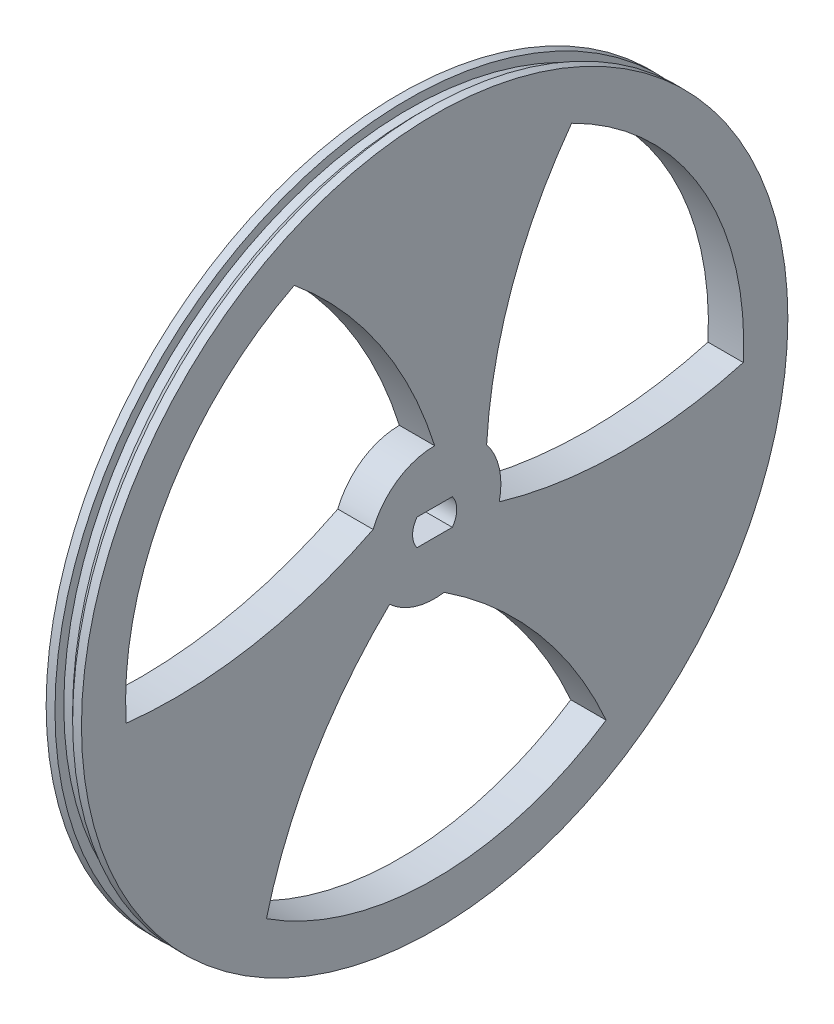
ISO-10303-21;
HEADER;
FILE_DESCRIPTION(('STEP AP214'),'2;1');
FILE_NAME('part.step','',(''),(''),'','','');
FILE_SCHEMA(('AUTOMOTIVE_DESIGN { 1 0 10303 214 1 1 1 1 }'));
ENDSEC;
DATA;
#1=APPLICATION_CONTEXT('core data for automotive mechanical design processes');
#2=APPLICATION_PROTOCOL_DEFINITION('international standard','automotive_design',2000,#1);
#3=PRODUCT_CONTEXT('',#1,'mechanical');
#4=PRODUCT('Part','Part','',(#3));
#5=PRODUCT_RELATED_PRODUCT_CATEGORY('part','',(#4));
#6=PRODUCT_DEFINITION_FORMATION('','',#4);
#7=PRODUCT_DEFINITION_CONTEXT('part definition',#1,'design');
#8=PRODUCT_DEFINITION('design','',#6,#7);
#9=PRODUCT_DEFINITION_SHAPE('','',#8);
#10=(LENGTH_UNIT() NAMED_UNIT(*) SI_UNIT(.MILLI.,.METRE.));
#11=(NAMED_UNIT(*) PLANE_ANGLE_UNIT() SI_UNIT($,.RADIAN.));
#12=(NAMED_UNIT(*) SI_UNIT($,.STERADIAN.) SOLID_ANGLE_UNIT());
#13=UNCERTAINTY_MEASURE_WITH_UNIT(LENGTH_MEASURE(1.E-05),#10,'distance_accuracy_value','');
#14=(GEOMETRIC_REPRESENTATION_CONTEXT(3) GLOBAL_UNCERTAINTY_ASSIGNED_CONTEXT((#13)) GLOBAL_UNIT_ASSIGNED_CONTEXT((#10,
#11,#12)) REPRESENTATION_CONTEXT('',''));
#15=CARTESIAN_POINT('',(0.,0.,0.));
#16=DIRECTION('',(0.,0.,1.));
#17=DIRECTION('',(1.,0.,0.));
#18=AXIS2_PLACEMENT_3D('',#15,#16,#17);
#19=CARTESIAN_POINT('',(-1.59907301805054,0.,0.));
#20=DIRECTION('',(-1.,0.,0.));
#21=DIRECTION('',(0.,0.,1.));
#22=AXIS2_PLACEMENT_3D('',#19,#20,#21);
#23=CYLINDRICAL_SURFACE('',#22,39.);
#24=CARTESIAN_POINT('',(1.,0.,0.));
#25=DIRECTION('',(-1.,0.,0.));
#26=DIRECTION('',(0.,0.,1.));
#27=AXIS2_PLACEMENT_3D('',#24,#25,#26);
#28=CIRCLE('',#27,39.);
#29=CARTESIAN_POINT('',(1.,0.,39.));
#30=VERTEX_POINT('',#29);
#31=EDGE_CURVE('E188',#30,#30,#28,.T.);
#32=ORIENTED_EDGE('',*,*,#31,.F.);
#33=EDGE_LOOP('',(#32));
#34=FACE_BOUND('',#33,.T.);
#35=CARTESIAN_POINT('',(2.,0.,0.));
#36=DIRECTION('',(-1.,0.,0.));
#37=DIRECTION('',(0.,0.,1.));
#38=AXIS2_PLACEMENT_3D('',#35,#36,#37);
#39=CIRCLE('',#38,39.);
#40=CARTESIAN_POINT('',(2.,0.,39.));
#41=VERTEX_POINT('',#40);
#42=EDGE_CURVE('E377',#41,#41,#39,.T.);
#43=ORIENTED_EDGE('',*,*,#42,.T.);
#44=EDGE_LOOP('',(#43));
#45=FACE_BOUND('',#44,.T.);
#46=ADVANCED_FACE('F39',(#34,#45),#23,.T.);
#47=CARTESIAN_POINT('',(4.,0.,0.));
#48=DIRECTION('',(-1.,0.,0.));
#49=DIRECTION('',(0.,0.,1.));
#50=AXIS2_PLACEMENT_3D('',#47,#48,#49);
#51=CYLINDRICAL_SURFACE('',#50,40.);
#52=CARTESIAN_POINT('',(0.,0.,0.));
#53=DIRECTION('',(1.,0.,0.));
#54=DIRECTION('',(0.,0.,-1.));
#55=AXIS2_PLACEMENT_3D('',#52,#53,#54);
#56=CIRCLE('',#55,40.);
#57=CARTESIAN_POINT('',(0.,0.,-40.));
#58=VERTEX_POINT('',#57);
#59=EDGE_CURVE('E43',#58,#58,#56,.T.);
#60=ORIENTED_EDGE('',*,*,#59,.T.);
#61=EDGE_LOOP('',(#60));
#62=FACE_BOUND('',#61,.T.);
#63=CARTESIAN_POINT('',(1.,0.,0.));
#64=DIRECTION('',(-1.,0.,0.));
#65=DIRECTION('',(0.,0.,1.));
#66=AXIS2_PLACEMENT_3D('',#63,#64,#65);
#67=CIRCLE('',#66,40.);
#68=CARTESIAN_POINT('',(1.,0.,40.));
#69=VERTEX_POINT('',#68);
#70=EDGE_CURVE('E383',#69,#69,#67,.T.);
#71=ORIENTED_EDGE('',*,*,#70,.T.);
#72=EDGE_LOOP('',(#71));
#73=FACE_BOUND('',#72,.T.);
#74=ADVANCED_FACE('F41',(#62,#73),#51,.T.);
#75=CARTESIAN_POINT('',(4.,0.,0.));
#76=DIRECTION('',(1.,0.,0.));
#77=DIRECTION('',(0.,0.,-1.));
#78=AXIS2_PLACEMENT_3D('',#75,#76,#77);
#79=CIRCLE('',#78,40.);
#80=CARTESIAN_POINT('',(4.,0.,-40.));
#81=VERTEX_POINT('',#80);
#82=EDGE_CURVE('E11',#81,#81,#79,.T.);
#83=ORIENTED_EDGE('',*,*,#82,.F.);
#84=EDGE_LOOP('',(#83));
#85=FACE_BOUND('',#84,.T.);
#86=CARTESIAN_POINT('',(3.,0.,0.));
#87=DIRECTION('',(-1.,0.,0.));
#88=DIRECTION('',(0.,0.,1.));
#89=AXIS2_PLACEMENT_3D('',#86,#87,#88);
#90=CIRCLE('',#89,40.);
#91=CARTESIAN_POINT('',(3.,0.,40.));
#92=VERTEX_POINT('',#91);
#93=EDGE_CURVE('E380',#92,#92,#90,.T.);
#94=ORIENTED_EDGE('',*,*,#93,.F.);
#95=EDGE_LOOP('',(#94));
#96=FACE_BOUND('',#95,.T.);
#97=ADVANCED_FACE('F366',(#85,#96),#51,.T.);
#98=CARTESIAN_POINT('',(4.,0.,0.));
#99=DIRECTION('',(1.,0.,0.));
#100=DIRECTION('',(0.,0.,-1.));
#101=AXIS2_PLACEMENT_3D('',#98,#99,#100);
#102=PLANE('',#101);
#103=ORIENTED_EDGE('',*,*,#82,.T.);
#104=EDGE_LOOP('',(#103));
#105=FACE_BOUND('',#104,.T.);
#106=DIRECTION('',(0.,0.,1.));
#107=VECTOR('',#106,1.);
#108=CARTESIAN_POINT('',(4.,1.5,2.));
#109=LINE('',#108,#107);
#110=CARTESIAN_POINT('',(4.,1.5,-2.));
#111=VERTEX_POINT('',#110);
#112=CARTESIAN_POINT('',(4.,1.5,2.));
#113=VERTEX_POINT('',#112);
#114=EDGE_CURVE('E293',#111,#113,#109,.T.);
#115=ORIENTED_EDGE('',*,*,#114,.F.);
#116=CARTESIAN_POINT('',(4.,0.,0.));
#117=DIRECTION('',(1.,0.,0.));
#118=DIRECTION('',(0.,0.,-1.));
#119=AXIS2_PLACEMENT_3D('',#116,#117,#118);
#120=CIRCLE('',#119,2.5);
#121=CARTESIAN_POINT('',(4.,-1.5,-2.));
#122=VERTEX_POINT('',#121);
#123=EDGE_CURVE('E290',#122,#111,#120,.T.);
#124=ORIENTED_EDGE('',*,*,#123,.F.);
#125=DIRECTION('',(0.,0.,-1.));
#126=VECTOR('',#125,1.);
#127=CARTESIAN_POINT('',(4.,-1.5,-2.));
#128=LINE('',#127,#126);
#129=CARTESIAN_POINT('',(4.,-1.5,2.));
#130=VERTEX_POINT('',#129);
#131=EDGE_CURVE('E301',#130,#122,#128,.T.);
#132=ORIENTED_EDGE('',*,*,#131,.F.);
#133=CARTESIAN_POINT('',(4.,0.,0.));
#134=DIRECTION('',(1.,0.,0.));
#135=DIRECTION('',(0.,0.,-1.));
#136=AXIS2_PLACEMENT_3D('',#133,#134,#135);
#137=CIRCLE('',#136,2.5);
#138=EDGE_CURVE('E297',#113,#130,#137,.T.);
#139=ORIENTED_EDGE('',*,*,#138,.F.);
#140=EDGE_LOOP('',(#115,#124,#132,#139));
#141=FACE_BOUND('',#140,.T.);
#142=CARTESIAN_POINT('',(4.,1.76584881371052,-55.8030158301804));
#143=DIRECTION('',(1.,0.,0.));
#144=DIRECTION('',(0.,0.,1.));
#145=AXIS2_PLACEMENT_3D('',#142,#143,#144);
#146=CIRCLE('',#145,50.);
#147=CARTESIAN_POINT('',(4.,31.3745456526574,-15.5125073759634));
#148=VERTEX_POINT('',#147);
#149=CARTESIAN_POINT('',(4.,4.64792982990707,-5.88614885101115));
#150=VERTEX_POINT('',#149);
#151=EDGE_CURVE('E250',#148,#150,#146,.T.);
#152=ORIENTED_EDGE('',*,*,#151,.F.);
#153=CARTESIAN_POINT('',(4.,0.,0.));
#154=DIRECTION('',(1.,0.,0.));
#155=DIRECTION('',(0.,0.,-1.));
#156=AXIS2_PLACEMENT_3D('',#153,#154,#155);
#157=CIRCLE('',#156,35.);
#158=CARTESIAN_POINT('',(4.,-1.81692167953096,-34.9528081219585));
#159=VERTEX_POINT('',#158);
#160=EDGE_CURVE('E247',#159,#148,#157,.T.);
#161=ORIENTED_EDGE('',*,*,#160,.F.);
#162=CARTESIAN_POINT('',(4.,46.3109136480361,-21.3987878075799));
#163=DIRECTION('',(1.,0.,0.));
#164=DIRECTION('',(0.,0.,-1.));
#165=AXIS2_PLACEMENT_3D('',#162,#163,#164);
#166=CIRCLE('',#165,50.);
#167=CARTESIAN_POINT('',(4.,-1.66400418565392,-7.31307664872495));
#168=VERTEX_POINT('',#167);
#169=EDGE_CURVE('E258',#168,#159,#166,.T.);
#170=ORIENTED_EDGE('',*,*,#169,.F.);
#171=CARTESIAN_POINT('',(4.,0.,0.));
#172=DIRECTION('',(-1.,0.,0.));
#173=DIRECTION('',(0.,0.,-1.));
#174=AXIS2_PLACEMENT_3D('',#171,#172,#173);
#175=CIRCLE('',#174,7.5);
#176=EDGE_CURVE('E254',#150,#168,#175,.T.);
#177=ORIENTED_EDGE('',*,*,#176,.F.);
#178=EDGE_LOOP('',(#152,#161,#170,#177));
#179=FACE_BOUND('',#178,.T.);
#180=CARTESIAN_POINT('',(4.,0.,0.));
#181=DIRECTION('',(1.,0.,0.));
#182=DIRECTION('',(0.,0.,-1.));
#183=AXIS2_PLACEMENT_3D('',#180,#181,#182);
#184=CIRCLE('',#183,35.);
#185=CARTESIAN_POINT('',(4.,31.1784806069845,15.9029037298189));
#186=VERTEX_POINT('',#185);
#187=CARTESIAN_POINT('',(4.,-2.25304736235283,34.9274072553775));
#188=VERTEX_POINT('',#187);
#189=EDGE_CURVE('E207',#186,#188,#184,.T.);
#190=ORIENTED_EDGE('',*,*,#189,.F.);
#191=CARTESIAN_POINT('',(4.,-7.37984247753008,47.7345816766408));
#192=DIRECTION('',(1.,0.,0.));
#193=DIRECTION('',(0.,0.,-1.));
#194=AXIS2_PLACEMENT_3D('',#191,#192,#193);
#195=CIRCLE('',#194,50.);
#196=CARTESIAN_POINT('',(4.,7.5,0.));
#197=VERTEX_POINT('',#196);
#198=EDGE_CURVE('E204',#197,#186,#195,.T.);
#199=ORIENTED_EDGE('',*,*,#198,.F.);
#200=CARTESIAN_POINT('',(4.,0.,0.));
#201=DIRECTION('',(-1.,0.,0.));
#202=DIRECTION('',(0.,0.,-1.));
#203=AXIS2_PLACEMENT_3D('',#200,#201,#202);
#204=CIRCLE('',#203,7.5);
#205=CARTESIAN_POINT('',(4.,2.77358952047597,6.96829973321368));
#206=VERTEX_POINT('',#205);
#207=EDGE_CURVE('E215',#206,#197,#204,.T.);
#208=ORIENTED_EDGE('',*,*,#207,.F.);
#209=CARTESIAN_POINT('',(4.,47.4439049098642,29.4307778470056));
#210=DIRECTION('',(1.,0.,0.));
#211=DIRECTION('',(0.,0.,1.));
#212=AXIS2_PLACEMENT_3D('',#209,#210,#211);
#213=CIRCLE('',#212,50.);
#214=EDGE_CURVE('E211',#188,#206,#213,.T.);
#215=ORIENTED_EDGE('',*,*,#214,.F.);
#216=EDGE_LOOP('',(#190,#199,#208,#215));
#217=FACE_BOUND('',#216,.T.);
#218=CARTESIAN_POINT('',(4.,-49.2097537235772,26.3722379831724));
#219=DIRECTION('',(1.,0.,0.));
#220=DIRECTION('',(0.,0.,1.));
#221=AXIS2_PLACEMENT_3D('',#218,#219,#220);
#222=CIRCLE('',#221,50.);
#223=CARTESIAN_POINT('',(4.,-29.1214982903056,-19.4148998794156));
#224=VERTEX_POINT('',#223);
#225=CARTESIAN_POINT('',(4.,-7.42151935038565,-1.08215088220237));
#226=VERTEX_POINT('',#225);
#227=EDGE_CURVE('E162',#224,#226,#222,.T.);
#228=ORIENTED_EDGE('',*,*,#227,.F.);
#229=CARTESIAN_POINT('',(4.,0.,0.));
#230=DIRECTION('',(1.,0.,0.));
#231=DIRECTION('',(0.,0.,-1.));
#232=AXIS2_PLACEMENT_3D('',#229,#230,#231);
#233=CIRCLE('',#232,35.);
#234=CARTESIAN_POINT('',(4.,-29.3615589274536,19.0499043921399));
#235=VERTEX_POINT('',#234);
#236=EDGE_CURVE('E153',#235,#224,#233,.T.);
#237=ORIENTED_EDGE('',*,*,#236,.F.);
#238=CARTESIAN_POINT('',(4.,-41.6873506755751,-29.4070337878766));
#239=DIRECTION('',(1.,0.,0.));
#240=DIRECTION('',(0.,0.,-1.));
#241=AXIS2_PLACEMENT_3D('',#238,#239,#240);
#242=CIRCLE('',#241,50.);
#243=CARTESIAN_POINT('',(4.,-5.50130806479159,5.09760822114245));
#244=VERTEX_POINT('',#243);
#245=EDGE_CURVE('E180',#244,#235,#242,.T.);
#246=ORIENTED_EDGE('',*,*,#245,.F.);
#247=CARTESIAN_POINT('',(4.,0.,0.));
#248=DIRECTION('',(-1.,0.,0.));
#249=DIRECTION('',(0.,0.,-1.));
#250=AXIS2_PLACEMENT_3D('',#247,#248,#249);
#251=CIRCLE('',#250,7.5);
#252=EDGE_CURVE('E176',#226,#244,#251,.T.);
#253=ORIENTED_EDGE('',*,*,#252,.F.);
#254=EDGE_LOOP('',(#228,#237,#246,#253));
#255=FACE_BOUND('',#254,.T.);
#256=ADVANCED_FACE('F175',(#105,#141,#179,#217,#255),#102,.T.);
#257=CARTESIAN_POINT('',(0.,0.,0.));
#258=DIRECTION('',(1.,0.,0.));
#259=DIRECTION('',(0.,0.,-1.));
#260=AXIS2_PLACEMENT_3D('',#257,#258,#259);
#261=PLANE('',#260);
#262=CARTESIAN_POINT('',(0.,-7.37984247753008,47.7345816766408));
#263=DIRECTION('',(1.,0.,0.));
#264=DIRECTION('',(0.,0.,-1.));
#265=AXIS2_PLACEMENT_3D('',#262,#263,#264);
#266=CIRCLE('',#265,50.);
#267=CARTESIAN_POINT('',(0.,7.5,0.));
#268=VERTEX_POINT('',#267);
#269=CARTESIAN_POINT('',(0.,31.1784806069845,15.9029037298189));
#270=VERTEX_POINT('',#269);
#271=EDGE_CURVE('E171',#268,#270,#266,.T.);
#272=ORIENTED_EDGE('',*,*,#271,.T.);
#273=CARTESIAN_POINT('',(0.,0.,0.));
#274=DIRECTION('',(1.,0.,0.));
#275=DIRECTION('',(0.,0.,-1.));
#276=AXIS2_PLACEMENT_3D('',#273,#274,#275);
#277=CIRCLE('',#276,35.);
#278=CARTESIAN_POINT('',(0.,-2.25304736235283,34.9274072553775));
#279=VERTEX_POINT('',#278);
#280=EDGE_CURVE('E222',#270,#279,#277,.T.);
#281=ORIENTED_EDGE('',*,*,#280,.T.);
#282=CARTESIAN_POINT('',(0.,47.4439049098642,29.4307778470056));
#283=DIRECTION('',(1.,0.,0.));
#284=DIRECTION('',(0.,0.,1.));
#285=AXIS2_PLACEMENT_3D('',#282,#283,#284);
#286=CIRCLE('',#285,50.);
#287=CARTESIAN_POINT('',(0.,2.77358952047597,6.96829973321369));
#288=VERTEX_POINT('',#287);
#289=EDGE_CURVE('E226',#279,#288,#286,.T.);
#290=ORIENTED_EDGE('',*,*,#289,.T.);
#291=CARTESIAN_POINT('',(0.,0.,0.));
#292=DIRECTION('',(-1.,0.,0.));
#293=DIRECTION('',(0.,0.,-1.));
#294=AXIS2_PLACEMENT_3D('',#291,#292,#293);
#295=CIRCLE('',#294,7.5);
#296=EDGE_CURVE('E208',#288,#268,#295,.T.);
#297=ORIENTED_EDGE('',*,*,#296,.T.);
#298=EDGE_LOOP('',(#272,#281,#290,#297));
#299=FACE_BOUND('',#298,.T.);
#300=CARTESIAN_POINT('',(0.,0.,0.));
#301=DIRECTION('',(1.,0.,0.));
#302=DIRECTION('',(0.,0.,-1.));
#303=AXIS2_PLACEMENT_3D('',#300,#301,#302);
#304=CIRCLE('',#303,2.5);
#305=CARTESIAN_POINT('',(0.,-1.5,-2.));
#306=VERTEX_POINT('',#305);
#307=CARTESIAN_POINT('',(0.,1.5,-2.));
#308=VERTEX_POINT('',#307);
#309=EDGE_CURVE('E289',#306,#308,#304,.T.);
#310=ORIENTED_EDGE('',*,*,#309,.T.);
#311=DIRECTION('',(0.,0.,1.));
#312=VECTOR('',#311,1.);
#313=CARTESIAN_POINT('',(0.,1.5,2.));
#314=LINE('',#313,#312);
#315=CARTESIAN_POINT('',(0.,1.5,2.));
#316=VERTEX_POINT('',#315);
#317=EDGE_CURVE('E308',#308,#316,#314,.T.);
#318=ORIENTED_EDGE('',*,*,#317,.T.);
#319=CARTESIAN_POINT('',(0.,0.,0.));
#320=DIRECTION('',(1.,0.,0.));
#321=DIRECTION('',(0.,0.,-1.));
#322=AXIS2_PLACEMENT_3D('',#319,#320,#321);
#323=CIRCLE('',#322,2.5);
#324=CARTESIAN_POINT('',(0.,-1.5,2.));
#325=VERTEX_POINT('',#324);
#326=EDGE_CURVE('E312',#316,#325,#323,.T.);
#327=ORIENTED_EDGE('',*,*,#326,.T.);
#328=DIRECTION('',(0.,0.,-1.));
#329=VECTOR('',#328,1.);
#330=CARTESIAN_POINT('',(0.,-1.5,-2.));
#331=LINE('',#330,#329);
#332=EDGE_CURVE('E294',#325,#306,#331,.T.);
#333=ORIENTED_EDGE('',*,*,#332,.T.);
#334=EDGE_LOOP('',(#310,#318,#327,#333));
#335=FACE_BOUND('',#334,.T.);
#336=ORIENTED_EDGE('',*,*,#59,.F.);
#337=EDGE_LOOP('',(#336));
#338=FACE_BOUND('',#337,.T.);
#339=CARTESIAN_POINT('',(0.,0.,0.));
#340=DIRECTION('',(1.,0.,0.));
#341=DIRECTION('',(0.,0.,-1.));
#342=AXIS2_PLACEMENT_3D('',#339,#340,#341);
#343=CIRCLE('',#342,35.);
#344=CARTESIAN_POINT('',(0.,-1.81692167953095,-34.9528081219585));
#345=VERTEX_POINT('',#344);
#346=CARTESIAN_POINT('',(0.,31.3745456526574,-15.5125073759634));
#347=VERTEX_POINT('',#346);
#348=EDGE_CURVE('E246',#345,#347,#343,.T.);
#349=ORIENTED_EDGE('',*,*,#348,.T.);
#350=CARTESIAN_POINT('',(0.,1.76584881371052,-55.8030158301804));
#351=DIRECTION('',(1.,0.,0.));
#352=DIRECTION('',(0.,0.,1.));
#353=AXIS2_PLACEMENT_3D('',#350,#351,#352);
#354=CIRCLE('',#353,50.);
#355=CARTESIAN_POINT('',(0.,4.64792982990707,-5.88614885101115));
#356=VERTEX_POINT('',#355);
#357=EDGE_CURVE('E265',#347,#356,#354,.T.);
#358=ORIENTED_EDGE('',*,*,#357,.T.);
#359=CARTESIAN_POINT('',(0.,0.,0.));
#360=DIRECTION('',(-1.,0.,0.));
#361=DIRECTION('',(0.,0.,-1.));
#362=AXIS2_PLACEMENT_3D('',#359,#360,#361);
#363=CIRCLE('',#362,7.5);
#364=CARTESIAN_POINT('',(0.,-1.66400418565392,-7.31307664872495));
#365=VERTEX_POINT('',#364);
#366=EDGE_CURVE('E269',#356,#365,#363,.T.);
#367=ORIENTED_EDGE('',*,*,#366,.T.);
#368=CARTESIAN_POINT('',(0.,46.3109136480361,-21.3987878075799));
#369=DIRECTION('',(1.,0.,0.));
#370=DIRECTION('',(0.,0.,-1.));
#371=AXIS2_PLACEMENT_3D('',#368,#369,#370);
#372=CIRCLE('',#371,50.);
#373=EDGE_CURVE('E251',#365,#345,#372,.T.);
#374=ORIENTED_EDGE('',*,*,#373,.T.);
#375=EDGE_LOOP('',(#349,#358,#367,#374));
#376=FACE_BOUND('',#375,.T.);
#377=CARTESIAN_POINT('',(0.,0.,0.));
#378=DIRECTION('',(1.,0.,0.));
#379=DIRECTION('',(0.,0.,-1.));
#380=AXIS2_PLACEMENT_3D('',#377,#378,#379);
#381=CIRCLE('',#380,35.);
#382=CARTESIAN_POINT('',(0.,-29.3615589274536,19.0499043921399));
#383=VERTEX_POINT('',#382);
#384=CARTESIAN_POINT('',(0.,-29.1214982903056,-19.4148998794156));
#385=VERTEX_POINT('',#384);
#386=EDGE_CURVE('E63',#383,#385,#381,.T.);
#387=ORIENTED_EDGE('',*,*,#386,.T.);
#388=CARTESIAN_POINT('',(0.,-49.2097537235772,26.3722379831724));
#389=DIRECTION('',(1.,0.,0.));
#390=DIRECTION('',(0.,0.,1.));
#391=AXIS2_PLACEMENT_3D('',#388,#389,#390);
#392=CIRCLE('',#391,50.);
#393=CARTESIAN_POINT('',(0.,-7.42151935038565,-1.08215088220237));
#394=VERTEX_POINT('',#393);
#395=EDGE_CURVE('E169',#385,#394,#392,.T.);
#396=ORIENTED_EDGE('',*,*,#395,.T.);
#397=CARTESIAN_POINT('',(0.,0.,0.));
#398=DIRECTION('',(-1.,0.,0.));
#399=DIRECTION('',(0.,0.,-1.));
#400=AXIS2_PLACEMENT_3D('',#397,#398,#399);
#401=CIRCLE('',#400,7.5);
#402=CARTESIAN_POINT('',(0.,-5.50130806479159,5.09760822114244));
#403=VERTEX_POINT('',#402);
#404=EDGE_CURVE('E191',#394,#403,#401,.T.);
#405=ORIENTED_EDGE('',*,*,#404,.T.);
#406=CARTESIAN_POINT('',(0.,-41.6873506755751,-29.4070337878766));
#407=DIRECTION('',(1.,0.,0.));
#408=DIRECTION('',(0.,0.,-1.));
#409=AXIS2_PLACEMENT_3D('',#406,#407,#408);
#410=CIRCLE('',#409,50.);
#411=EDGE_CURVE('E163',#403,#383,#410,.T.);
#412=ORIENTED_EDGE('',*,*,#411,.T.);
#413=EDGE_LOOP('',(#387,#396,#405,#412));
#414=FACE_BOUND('',#413,.T.);
#415=ADVANCED_FACE('F339',(#299,#335,#338,#376,#414),#261,.F.);
#416=CARTESIAN_POINT('',(4.,0.,0.));
#417=DIRECTION('',(-1.,0.,0.));
#418=DIRECTION('',(0.,0.,1.));
#419=AXIS2_PLACEMENT_3D('',#416,#417,#418);
#420=CYLINDRICAL_SURFACE('',#419,2.5);
#421=ORIENTED_EDGE('',*,*,#309,.F.);
#422=DIRECTION('',(-1.,0.,0.));
#423=VECTOR('',#422,1.);
#424=CARTESIAN_POINT('',(4.,-1.5,-2.));
#425=LINE('',#424,#423);
#426=EDGE_CURVE('E304',#122,#306,#425,.T.);
#427=ORIENTED_EDGE('',*,*,#426,.F.);
#428=ORIENTED_EDGE('',*,*,#123,.T.);
#429=DIRECTION('',(-1.,0.,0.));
#430=VECTOR('',#429,1.);
#431=CARTESIAN_POINT('',(4.,1.5,-2.));
#432=LINE('',#431,#430);
#433=EDGE_CURVE('E328',#111,#308,#432,.T.);
#434=ORIENTED_EDGE('',*,*,#433,.T.);
#435=EDGE_LOOP('',(#421,#427,#428,#434));
#436=FACE_BOUND('',#435,.T.);
#437=ADVANCED_FACE('F342',(#436),#420,.F.);
#438=CARTESIAN_POINT('',(4.,1.5,2.));
#439=DIRECTION('',(0.,-1.,0.));
#440=DIRECTION('',(0.,0.,-1.));
#441=AXIS2_PLACEMENT_3D('',#438,#439,#440);
#442=PLANE('',#441);
#443=ORIENTED_EDGE('',*,*,#317,.F.);
#444=ORIENTED_EDGE('',*,*,#433,.F.);
#445=ORIENTED_EDGE('',*,*,#114,.T.);
#446=DIRECTION('',(-1.,0.,0.));
#447=VECTOR('',#446,1.);
#448=CARTESIAN_POINT('',(4.,1.5,2.));
#449=LINE('',#448,#447);
#450=EDGE_CURVE('E325',#113,#316,#449,.T.);
#451=ORIENTED_EDGE('',*,*,#450,.T.);
#452=EDGE_LOOP('',(#443,#444,#445,#451));
#453=FACE_BOUND('',#452,.T.);
#454=ADVANCED_FACE('F466',(#453),#442,.T.);
#455=CARTESIAN_POINT('',(4.,0.,0.));
#456=DIRECTION('',(-1.,0.,0.));
#457=DIRECTION('',(0.,0.,1.));
#458=AXIS2_PLACEMENT_3D('',#455,#456,#457);
#459=CYLINDRICAL_SURFACE('',#458,2.5);
#460=ORIENTED_EDGE('',*,*,#326,.F.);
#461=ORIENTED_EDGE('',*,*,#450,.F.);
#462=ORIENTED_EDGE('',*,*,#138,.T.);
#463=DIRECTION('',(-1.,0.,0.));
#464=VECTOR('',#463,1.);
#465=CARTESIAN_POINT('',(4.,-1.5,2.));
#466=LINE('',#465,#464);
#467=EDGE_CURVE('E322',#130,#325,#466,.T.);
#468=ORIENTED_EDGE('',*,*,#467,.T.);
#469=EDGE_LOOP('',(#460,#461,#462,#468));
#470=FACE_BOUND('',#469,.T.);
#471=ADVANCED_FACE('F462',(#470),#459,.F.);
#472=CARTESIAN_POINT('',(4.,-1.5,-2.));
#473=DIRECTION('',(0.,1.,0.));
#474=DIRECTION('',(0.,0.,1.));
#475=AXIS2_PLACEMENT_3D('',#472,#473,#474);
#476=PLANE('',#475);
#477=ORIENTED_EDGE('',*,*,#332,.F.);
#478=ORIENTED_EDGE('',*,*,#467,.F.);
#479=ORIENTED_EDGE('',*,*,#131,.T.);
#480=ORIENTED_EDGE('',*,*,#426,.T.);
#481=EDGE_LOOP('',(#477,#478,#479,#480));
#482=FACE_BOUND('',#481,.T.);
#483=ADVANCED_FACE('F458',(#482),#476,.T.);
#484=CARTESIAN_POINT('',(4.,0.,0.));
#485=DIRECTION('',(-1.,0.,0.));
#486=DIRECTION('',(0.,0.,1.));
#487=AXIS2_PLACEMENT_3D('',#484,#485,#486);
#488=CYLINDRICAL_SURFACE('',#487,35.);
#489=ORIENTED_EDGE('',*,*,#348,.F.);
#490=DIRECTION('',(-1.,0.,0.));
#491=VECTOR('',#490,1.);
#492=CARTESIAN_POINT('',(4.,-1.81692167953096,-34.9528081219585));
#493=LINE('',#492,#491);
#494=EDGE_CURVE('E261',#159,#345,#493,.T.);
#495=ORIENTED_EDGE('',*,*,#494,.F.);
#496=ORIENTED_EDGE('',*,*,#160,.T.);
#497=DIRECTION('',(-1.,0.,0.));
#498=VECTOR('',#497,1.);
#499=CARTESIAN_POINT('',(4.,31.3745456526574,-15.5125073759634));
#500=LINE('',#499,#498);
#501=EDGE_CURVE('E285',#148,#347,#500,.T.);
#502=ORIENTED_EDGE('',*,*,#501,.T.);
#503=EDGE_LOOP('',(#489,#495,#496,#502));
#504=FACE_BOUND('',#503,.T.);
#505=ADVANCED_FACE('F454',(#504),#488,.F.);
#506=CARTESIAN_POINT('',(4.,1.76584881371052,-55.8030158301804));
#507=DIRECTION('',(-1.,0.,0.));
#508=DIRECTION('',(0.,0.,1.));
#509=AXIS2_PLACEMENT_3D('',#506,#507,#508);
#510=CYLINDRICAL_SURFACE('',#509,50.);
#511=ORIENTED_EDGE('',*,*,#357,.F.);
#512=ORIENTED_EDGE('',*,*,#501,.F.);
#513=ORIENTED_EDGE('',*,*,#151,.T.);
#514=DIRECTION('',(-1.,0.,0.));
#515=VECTOR('',#514,1.);
#516=CARTESIAN_POINT('',(4.,4.64792982990707,-5.88614885101115));
#517=LINE('',#516,#515);
#518=EDGE_CURVE('E282',#150,#356,#517,.T.);
#519=ORIENTED_EDGE('',*,*,#518,.T.);
#520=EDGE_LOOP('',(#511,#512,#513,#519));
#521=FACE_BOUND('',#520,.T.);
#522=ADVANCED_FACE('F450',(#521),#510,.F.);
#523=CARTESIAN_POINT('',(4.,0.,0.));
#524=DIRECTION('',(-1.,0.,0.));
#525=DIRECTION('',(0.,0.,1.));
#526=AXIS2_PLACEMENT_3D('',#523,#524,#525);
#527=CYLINDRICAL_SURFACE('',#526,7.5);
#528=ORIENTED_EDGE('',*,*,#366,.F.);
#529=ORIENTED_EDGE('',*,*,#518,.F.);
#530=ORIENTED_EDGE('',*,*,#176,.T.);
#531=DIRECTION('',(-1.,0.,0.));
#532=VECTOR('',#531,1.);
#533=CARTESIAN_POINT('',(4.,-1.66400418565392,-7.31307664872495));
#534=LINE('',#533,#532);
#535=EDGE_CURVE('E279',#168,#365,#534,.T.);
#536=ORIENTED_EDGE('',*,*,#535,.T.);
#537=EDGE_LOOP('',(#528,#529,#530,#536));
#538=FACE_BOUND('',#537,.T.);
#539=ADVANCED_FACE('F446',(#538),#527,.T.);
#540=CARTESIAN_POINT('',(4.,46.3109136480361,-21.3987878075799));
#541=DIRECTION('',(-1.,0.,0.));
#542=DIRECTION('',(0.,0.,1.));
#543=AXIS2_PLACEMENT_3D('',#540,#541,#542);
#544=CYLINDRICAL_SURFACE('',#543,50.);
#545=ORIENTED_EDGE('',*,*,#373,.F.);
#546=ORIENTED_EDGE('',*,*,#535,.F.);
#547=ORIENTED_EDGE('',*,*,#169,.T.);
#548=ORIENTED_EDGE('',*,*,#494,.T.);
#549=EDGE_LOOP('',(#545,#546,#547,#548));
#550=FACE_BOUND('',#549,.T.);
#551=ADVANCED_FACE('F443',(#550),#544,.F.);
#552=CARTESIAN_POINT('',(4.,-7.37984247753008,47.7345816766408));
#553=DIRECTION('',(-1.,0.,0.));
#554=DIRECTION('',(0.,0.,1.));
#555=AXIS2_PLACEMENT_3D('',#552,#553,#554);
#556=CYLINDRICAL_SURFACE('',#555,50.);
#557=ORIENTED_EDGE('',*,*,#271,.F.);
#558=DIRECTION('',(-1.,0.,0.));
#559=VECTOR('',#558,1.);
#560=CARTESIAN_POINT('',(4.,7.5,0.));
#561=LINE('',#560,#559);
#562=EDGE_CURVE('E218',#197,#268,#561,.T.);
#563=ORIENTED_EDGE('',*,*,#562,.F.);
#564=ORIENTED_EDGE('',*,*,#198,.T.);
#565=DIRECTION('',(-1.,0.,0.));
#566=VECTOR('',#565,1.);
#567=CARTESIAN_POINT('',(4.,31.1784806069845,15.9029037298189));
#568=LINE('',#567,#566);
#569=EDGE_CURVE('E242',#186,#270,#568,.T.);
#570=ORIENTED_EDGE('',*,*,#569,.T.);
#571=EDGE_LOOP('',(#557,#563,#564,#570));
#572=FACE_BOUND('',#571,.T.);
#573=ADVANCED_FACE('F425',(#572),#556,.F.);
#574=CARTESIAN_POINT('',(4.,0.,0.));
#575=DIRECTION('',(-1.,0.,0.));
#576=DIRECTION('',(0.,0.,1.));
#577=AXIS2_PLACEMENT_3D('',#574,#575,#576);
#578=CYLINDRICAL_SURFACE('',#577,35.);
#579=ORIENTED_EDGE('',*,*,#280,.F.);
#580=ORIENTED_EDGE('',*,*,#569,.F.);
#581=ORIENTED_EDGE('',*,*,#189,.T.);
#582=DIRECTION('',(-1.,0.,0.));
#583=VECTOR('',#582,1.);
#584=CARTESIAN_POINT('',(4.,-2.25304736235283,34.9274072553775));
#585=LINE('',#584,#583);
#586=EDGE_CURVE('E239',#188,#279,#585,.T.);
#587=ORIENTED_EDGE('',*,*,#586,.T.);
#588=EDGE_LOOP('',(#579,#580,#581,#587));
#589=FACE_BOUND('',#588,.T.);
#590=ADVANCED_FACE('F418',(#589),#578,.F.);
#591=CARTESIAN_POINT('',(4.,47.4439049098642,29.4307778470056));
#592=DIRECTION('',(-1.,0.,0.));
#593=DIRECTION('',(0.,0.,1.));
#594=AXIS2_PLACEMENT_3D('',#591,#592,#593);
#595=CYLINDRICAL_SURFACE('',#594,50.);
#596=ORIENTED_EDGE('',*,*,#289,.F.);
#597=ORIENTED_EDGE('',*,*,#586,.F.);
#598=ORIENTED_EDGE('',*,*,#214,.T.);
#599=DIRECTION('',(-1.,0.,0.));
#600=VECTOR('',#599,1.);
#601=CARTESIAN_POINT('',(4.,2.77358952047597,6.96829973321369));
#602=LINE('',#601,#600);
#603=EDGE_CURVE('E236',#206,#288,#602,.T.);
#604=ORIENTED_EDGE('',*,*,#603,.T.);
#605=EDGE_LOOP('',(#596,#597,#598,#604));
#606=FACE_BOUND('',#605,.T.);
#607=ADVANCED_FACE('F421',(#606),#595,.F.);
#608=CARTESIAN_POINT('',(4.,0.,0.));
#609=DIRECTION('',(-1.,0.,0.));
#610=DIRECTION('',(0.,0.,1.));
#611=AXIS2_PLACEMENT_3D('',#608,#609,#610);
#612=CYLINDRICAL_SURFACE('',#611,7.5);
#613=ORIENTED_EDGE('',*,*,#296,.F.);
#614=ORIENTED_EDGE('',*,*,#603,.F.);
#615=ORIENTED_EDGE('',*,*,#207,.T.);
#616=ORIENTED_EDGE('',*,*,#562,.T.);
#617=EDGE_LOOP('',(#613,#614,#615,#616));
#618=FACE_BOUND('',#617,.T.);
#619=ADVANCED_FACE('F428',(#618),#612,.T.);
#620=CARTESIAN_POINT('',(4.,0.,0.));
#621=DIRECTION('',(-1.,0.,0.));
#622=DIRECTION('',(0.,0.,1.));
#623=AXIS2_PLACEMENT_3D('',#620,#621,#622);
#624=CYLINDRICAL_SURFACE('',#623,35.);
#625=ORIENTED_EDGE('',*,*,#386,.F.);
#626=DIRECTION('',(-1.,0.,0.));
#627=VECTOR('',#626,1.);
#628=CARTESIAN_POINT('',(4.,-29.3615589274536,19.0499043921399));
#629=LINE('',#628,#627);
#630=EDGE_CURVE('E157',#235,#383,#629,.T.);
#631=ORIENTED_EDGE('',*,*,#630,.F.);
#632=ORIENTED_EDGE('',*,*,#236,.T.);
#633=DIRECTION('',(-1.,0.,0.));
#634=VECTOR('',#633,1.);
#635=CARTESIAN_POINT('',(4.,-29.1214982903056,-19.4148998794156));
#636=LINE('',#635,#634);
#637=EDGE_CURVE('E156',#224,#385,#636,.T.);
#638=ORIENTED_EDGE('',*,*,#637,.T.);
#639=EDGE_LOOP('',(#625,#631,#632,#638));
#640=FACE_BOUND('',#639,.T.);
#641=ADVANCED_FACE('F155',(#640),#624,.F.);
#642=CARTESIAN_POINT('',(4.,-49.2097537235772,26.3722379831724));
#643=DIRECTION('',(-1.,0.,0.));
#644=DIRECTION('',(0.,0.,1.));
#645=AXIS2_PLACEMENT_3D('',#642,#643,#644);
#646=CYLINDRICAL_SURFACE('',#645,50.);
#647=ORIENTED_EDGE('',*,*,#395,.F.);
#648=ORIENTED_EDGE('',*,*,#637,.F.);
#649=ORIENTED_EDGE('',*,*,#227,.T.);
#650=DIRECTION('',(-1.,0.,0.));
#651=VECTOR('',#650,1.);
#652=CARTESIAN_POINT('',(4.,-7.42151935038565,-1.08215088220237));
#653=LINE('',#652,#651);
#654=EDGE_CURVE('E172',#226,#394,#653,.T.);
#655=ORIENTED_EDGE('',*,*,#654,.T.);
#656=EDGE_LOOP('',(#647,#648,#649,#655));
#657=FACE_BOUND('',#656,.T.);
#658=ADVANCED_FACE('F166',(#657),#646,.F.);
#659=CARTESIAN_POINT('',(4.,0.,0.));
#660=DIRECTION('',(-1.,0.,0.));
#661=DIRECTION('',(0.,0.,1.));
#662=AXIS2_PLACEMENT_3D('',#659,#660,#661);
#663=CYLINDRICAL_SURFACE('',#662,7.5);
#664=ORIENTED_EDGE('',*,*,#404,.F.);
#665=ORIENTED_EDGE('',*,*,#654,.F.);
#666=ORIENTED_EDGE('',*,*,#252,.T.);
#667=DIRECTION('',(-1.,0.,0.));
#668=VECTOR('',#667,1.);
#669=CARTESIAN_POINT('',(4.,-5.50130806479159,5.09760822114244));
#670=LINE('',#669,#668);
#671=EDGE_CURVE('E55',#244,#403,#670,.T.);
#672=ORIENTED_EDGE('',*,*,#671,.T.);
#673=EDGE_LOOP('',(#664,#665,#666,#672));
#674=FACE_BOUND('',#673,.T.);
#675=ADVANCED_FACE('F349',(#674),#663,.T.);
#676=CARTESIAN_POINT('',(4.,-41.6873506755751,-29.4070337878766));
#677=DIRECTION('',(-1.,0.,0.));
#678=DIRECTION('',(0.,0.,1.));
#679=AXIS2_PLACEMENT_3D('',#676,#677,#678);
#680=CYLINDRICAL_SURFACE('',#679,50.);
#681=ORIENTED_EDGE('',*,*,#411,.F.);
#682=ORIENTED_EDGE('',*,*,#671,.F.);
#683=ORIENTED_EDGE('',*,*,#245,.T.);
#684=ORIENTED_EDGE('',*,*,#630,.T.);
#685=EDGE_LOOP('',(#681,#682,#683,#684));
#686=FACE_BOUND('',#685,.T.);
#687=ADVANCED_FACE('F346',(#686),#680,.F.);
#688=CARTESIAN_POINT('',(1.,40.,0.));
#689=DIRECTION('',(1.,0.,0.));
#690=DIRECTION('',(0.,0.,-1.));
#691=AXIS2_PLACEMENT_3D('',#688,#689,#690);
#692=PLANE('',#691);
#693=ORIENTED_EDGE('',*,*,#31,.T.);
#694=EDGE_LOOP('',(#693));
#695=FACE_BOUND('',#694,.T.);
#696=ORIENTED_EDGE('',*,*,#70,.F.);
#697=EDGE_LOOP('',(#696));
#698=FACE_BOUND('',#697,.T.);
#699=ADVANCED_FACE('F348',(#695,#698),#692,.T.);
#700=CARTESIAN_POINT('',(3.,0.,0.));
#701=DIRECTION('',(1.,0.,0.));
#702=DIRECTION('',(0.,0.,-1.));
#703=AXIS2_PLACEMENT_3D('',#700,#701,#702);
#704=CONICAL_SURFACE('',#703,40.,0.785398163397452);
#705=ORIENTED_EDGE('',*,*,#42,.F.);
#706=EDGE_LOOP('',(#705));
#707=FACE_BOUND('',#706,.T.);
#708=ORIENTED_EDGE('',*,*,#93,.T.);
#709=EDGE_LOOP('',(#708));
#710=FACE_BOUND('',#709,.T.);
#711=ADVANCED_FACE('F355',(#707,#710),#704,.T.);
#712=CLOSED_SHELL('',(#46,#74,#97,#256,#415,#437,#454,#471,#483,#505,#522,#539,#551,#573,#590,
#607,#619,#641,#658,#675,#687,#699,#711));
#713=MANIFOLD_SOLID_BREP('B2',#712);
#714=ADVANCED_BREP_SHAPE_REPRESENTATION('',(#18,#713),#14);
#715=SHAPE_DEFINITION_REPRESENTATION(#9,#714);
ENDSEC;
END-ISO-10303-21;
